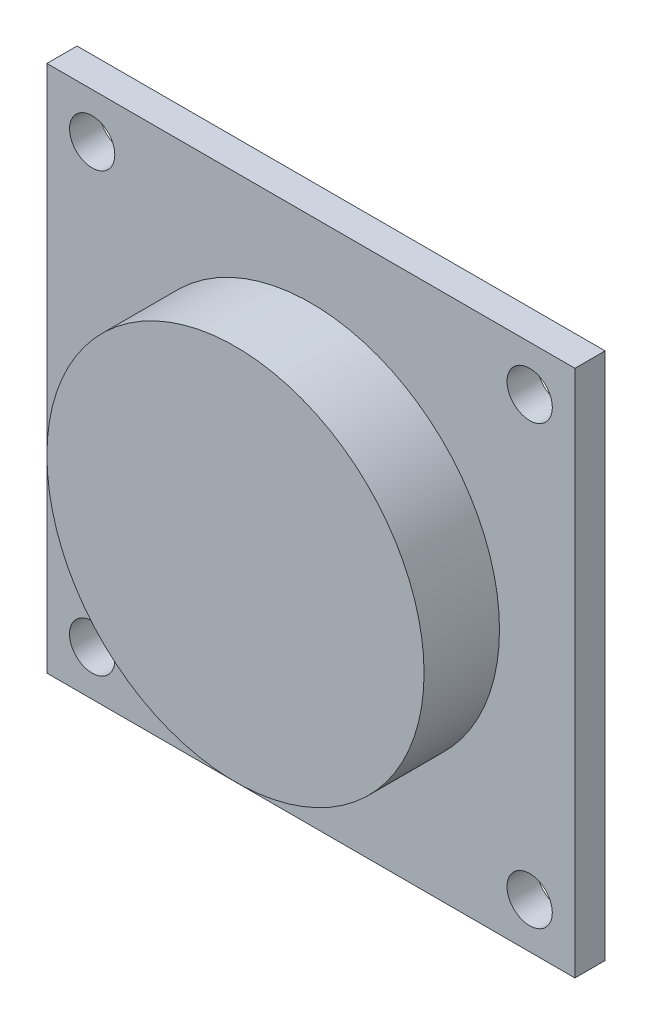
ISO-10303-21;
HEADER;
FILE_DESCRIPTION(('STEP AP214'),'2;1');
FILE_NAME('part.step','',(''),(''),'','','');
FILE_SCHEMA(('AUTOMOTIVE_DESIGN { 1 0 10303 214 1 1 1 1 }'));
ENDSEC;
DATA;
#1=APPLICATION_CONTEXT('core data for automotive mechanical design processes');
#2=APPLICATION_PROTOCOL_DEFINITION('international standard','automotive_design',2000,#1);
#3=PRODUCT_CONTEXT('',#1,'mechanical');
#4=PRODUCT('Part','Part','',(#3));
#5=PRODUCT_RELATED_PRODUCT_CATEGORY('part','',(#4));
#6=PRODUCT_DEFINITION_FORMATION('','',#4);
#7=PRODUCT_DEFINITION_CONTEXT('part definition',#1,'design');
#8=PRODUCT_DEFINITION('design','',#6,#7);
#9=PRODUCT_DEFINITION_SHAPE('','',#8);
#10=(LENGTH_UNIT() NAMED_UNIT(*) SI_UNIT(.MILLI.,.METRE.));
#11=(NAMED_UNIT(*) PLANE_ANGLE_UNIT() SI_UNIT($,.RADIAN.));
#12=(NAMED_UNIT(*) SI_UNIT($,.STERADIAN.) SOLID_ANGLE_UNIT());
#13=UNCERTAINTY_MEASURE_WITH_UNIT(LENGTH_MEASURE(1.E-05),#10,'distance_accuracy_value','');
#14=(GEOMETRIC_REPRESENTATION_CONTEXT(3) GLOBAL_UNCERTAINTY_ASSIGNED_CONTEXT((#13)) GLOBAL_UNIT_ASSIGNED_CONTEXT((#10,
#11,#12)) REPRESENTATION_CONTEXT('',''));
#15=CARTESIAN_POINT('',(0.,0.,0.));
#16=DIRECTION('',(0.,0.,1.));
#17=DIRECTION('',(1.,0.,0.));
#18=AXIS2_PLACEMENT_3D('',#15,#16,#17);
#19=CARTESIAN_POINT('',(-35.,35.,4.));
#20=DIRECTION('',(1.,0.,0.));
#21=DIRECTION('',(0.,1.,0.));
#22=AXIS2_PLACEMENT_3D('',#19,#20,#21);
#23=PLANE('',#22);
#24=DIRECTION('',(0.,-1.,0.));
#25=VECTOR('',#24,1.);
#26=CARTESIAN_POINT('',(-35.,35.,0.));
#27=LINE('',#26,#25);
#28=CARTESIAN_POINT('',(-35.,35.,0.));
#29=VERTEX_POINT('',#28);
#30=CARTESIAN_POINT('',(-35.,-35.,0.));
#31=VERTEX_POINT('',#30);
#32=EDGE_CURVE('E110',#29,#31,#27,.T.);
#33=ORIENTED_EDGE('',*,*,#32,.T.);
#34=DIRECTION('',(0.,0.,-1.));
#35=VECTOR('',#34,1.);
#36=CARTESIAN_POINT('',(-35.,-35.,4.));
#37=LINE('',#36,#35);
#38=CARTESIAN_POINT('',(-35.,-35.,4.));
#39=VERTEX_POINT('',#38);
#40=EDGE_CURVE('E97',#39,#31,#37,.T.);
#41=ORIENTED_EDGE('',*,*,#40,.F.);
#42=DIRECTION('',(0.,-1.,0.));
#43=VECTOR('',#42,1.);
#44=CARTESIAN_POINT('',(-35.,35.,4.));
#45=LINE('',#44,#43);
#46=CARTESIAN_POINT('',(-35.,35.,4.));
#47=VERTEX_POINT('',#46);
#48=EDGE_CURVE('E116',#47,#39,#45,.T.);
#49=ORIENTED_EDGE('',*,*,#48,.F.);
#50=DIRECTION('',(0.,0.,-1.));
#51=VECTOR('',#50,1.);
#52=CARTESIAN_POINT('',(-35.,35.,4.));
#53=LINE('',#52,#51);
#54=EDGE_CURVE('E99',#47,#29,#53,.T.);
#55=ORIENTED_EDGE('',*,*,#54,.T.);
#56=EDGE_LOOP('',(#33,#41,#49,#55));
#57=FACE_BOUND('',#56,.T.);
#58=ADVANCED_FACE('F43',(#57),#23,.F.);
#59=CARTESIAN_POINT('',(35.,-35.,4.));
#60=DIRECTION('',(0.,1.,0.));
#61=DIRECTION('',(-1.,0.,0.));
#62=AXIS2_PLACEMENT_3D('',#59,#60,#61);
#63=PLANE('',#62);
#64=DIRECTION('',(1.,0.,0.));
#65=VECTOR('',#64,1.);
#66=CARTESIAN_POINT('',(35.,-35.,0.));
#67=LINE('',#66,#65);
#68=CARTESIAN_POINT('',(35.,-35.,0.));
#69=VERTEX_POINT('',#68);
#70=EDGE_CURVE('E60',#31,#69,#67,.T.);
#71=ORIENTED_EDGE('',*,*,#70,.T.);
#72=DIRECTION('',(0.,0.,-1.));
#73=VECTOR('',#72,1.);
#74=CARTESIAN_POINT('',(35.,-35.,4.));
#75=LINE('',#74,#73);
#76=CARTESIAN_POINT('',(35.,-35.,4.));
#77=VERTEX_POINT('',#76);
#78=EDGE_CURVE('E94',#77,#69,#75,.T.);
#79=ORIENTED_EDGE('',*,*,#78,.F.);
#80=DIRECTION('',(1.,0.,0.));
#81=VECTOR('',#80,1.);
#82=CARTESIAN_POINT('',(35.,-35.,4.));
#83=LINE('',#82,#81);
#84=EDGE_CURVE('E76',#39,#77,#83,.T.);
#85=ORIENTED_EDGE('',*,*,#84,.F.);
#86=ORIENTED_EDGE('',*,*,#40,.T.);
#87=EDGE_LOOP('',(#71,#79,#85,#86));
#88=FACE_BOUND('',#87,.T.);
#89=ADVANCED_FACE('F93',(#88),#63,.F.);
#90=CARTESIAN_POINT('',(35.,35.,4.));
#91=DIRECTION('',(-1.,0.,0.));
#92=DIRECTION('',(0.,0.,1.));
#93=AXIS2_PLACEMENT_3D('',#90,#91,#92);
#94=PLANE('',#93);
#95=DIRECTION('',(0.,1.,0.));
#96=VECTOR('',#95,1.);
#97=CARTESIAN_POINT('',(35.,35.,0.));
#98=LINE('',#97,#96);
#99=CARTESIAN_POINT('',(35.,35.,0.));
#100=VERTEX_POINT('',#99);
#101=EDGE_CURVE('E91',#69,#100,#98,.T.);
#102=ORIENTED_EDGE('',*,*,#101,.T.);
#103=DIRECTION('',(0.,0.,-1.));
#104=VECTOR('',#103,1.);
#105=CARTESIAN_POINT('',(35.,35.,4.));
#106=LINE('',#105,#104);
#107=CARTESIAN_POINT('',(35.,35.,4.));
#108=VERTEX_POINT('',#107);
#109=EDGE_CURVE('E119',#108,#100,#106,.T.);
#110=ORIENTED_EDGE('',*,*,#109,.F.);
#111=DIRECTION('',(0.,1.,0.));
#112=VECTOR('',#111,1.);
#113=CARTESIAN_POINT('',(35.,35.,4.));
#114=LINE('',#113,#112);
#115=EDGE_CURVE('E102',#77,#108,#114,.T.);
#116=ORIENTED_EDGE('',*,*,#115,.F.);
#117=ORIENTED_EDGE('',*,*,#78,.T.);
#118=EDGE_LOOP('',(#102,#110,#116,#117));
#119=FACE_BOUND('',#118,.T.);
#120=ADVANCED_FACE('F101',(#119),#94,.F.);
#121=CARTESIAN_POINT('',(35.,35.,4.));
#122=DIRECTION('',(0.,-1.,0.));
#123=DIRECTION('',(1.,0.,0.));
#124=AXIS2_PLACEMENT_3D('',#121,#122,#123);
#125=PLANE('',#124);
#126=DIRECTION('',(-1.,0.,0.));
#127=VECTOR('',#126,1.);
#128=CARTESIAN_POINT('',(35.,35.,0.));
#129=LINE('',#128,#127);
#130=EDGE_CURVE('E85',#100,#29,#129,.T.);
#131=ORIENTED_EDGE('',*,*,#130,.T.);
#132=ORIENTED_EDGE('',*,*,#54,.F.);
#133=DIRECTION('',(-1.,0.,0.));
#134=VECTOR('',#133,1.);
#135=CARTESIAN_POINT('',(35.,35.,4.));
#136=LINE('',#135,#134);
#137=EDGE_CURVE('E52',#108,#47,#136,.T.);
#138=ORIENTED_EDGE('',*,*,#137,.F.);
#139=ORIENTED_EDGE('',*,*,#109,.T.);
#140=EDGE_LOOP('',(#131,#132,#138,#139));
#141=FACE_BOUND('',#140,.T.);
#142=ADVANCED_FACE('F126',(#141),#125,.F.);
#143=CARTESIAN_POINT('',(0.,0.,4.));
#144=DIRECTION('',(0.,0.,-1.));
#145=DIRECTION('',(-1.,0.,0.));
#146=AXIS2_PLACEMENT_3D('',#143,#144,#145);
#147=PLANE('',#146);
#148=CARTESIAN_POINT('',(29.,29.,4.));
#149=DIRECTION('',(0.,0.,1.));
#150=DIRECTION('',(-1.,0.,0.));
#151=AXIS2_PLACEMENT_3D('',#148,#149,#150);
#152=CIRCLE('',#151,3.00031163254123);
#153=CARTESIAN_POINT('',(25.9996883674588,29.,4.));
#154=VERTEX_POINT('',#153);
#155=EDGE_CURVE('E254',#154,#154,#152,.T.);
#156=ORIENTED_EDGE('',*,*,#155,.F.);
#157=EDGE_LOOP('',(#156));
#158=FACE_BOUND('',#157,.T.);
#159=CARTESIAN_POINT('',(-29.,-29.,4.));
#160=DIRECTION('',(0.,0.,1.));
#161=DIRECTION('',(-1.,0.,0.));
#162=AXIS2_PLACEMENT_3D('',#159,#160,#161);
#163=CIRCLE('',#162,3.00031163254123);
#164=CARTESIAN_POINT('',(-32.0003116325412,-29.,4.));
#165=VERTEX_POINT('',#164);
#166=EDGE_CURVE('E259',#165,#165,#163,.T.);
#167=ORIENTED_EDGE('',*,*,#166,.F.);
#168=EDGE_LOOP('',(#167));
#169=FACE_BOUND('',#168,.T.);
#170=CARTESIAN_POINT('',(29.,-29.,4.));
#171=DIRECTION('',(0.,0.,1.));
#172=DIRECTION('',(1.,0.,0.));
#173=AXIS2_PLACEMENT_3D('',#170,#171,#172);
#174=CIRCLE('',#173,3.00031163254123);
#175=CARTESIAN_POINT('',(32.0003116325412,-29.,4.));
#176=VERTEX_POINT('',#175);
#177=EDGE_CURVE('E267',#176,#176,#174,.T.);
#178=ORIENTED_EDGE('',*,*,#177,.F.);
#179=EDGE_LOOP('',(#178));
#180=FACE_BOUND('',#179,.T.);
#181=CARTESIAN_POINT('',(-29.,29.,4.));
#182=DIRECTION('',(0.,0.,1.));
#183=DIRECTION('',(1.,0.,0.));
#184=AXIS2_PLACEMENT_3D('',#181,#182,#183);
#185=CIRCLE('',#184,3.00031163254123);
#186=CARTESIAN_POINT('',(-25.9996883674588,29.,4.));
#187=VERTEX_POINT('',#186);
#188=EDGE_CURVE('E112',#187,#187,#185,.T.);
#189=ORIENTED_EDGE('',*,*,#188,.F.);
#190=EDGE_LOOP('',(#189));
#191=FACE_BOUND('',#190,.T.);
#192=CARTESIAN_POINT('',(0.,0.,4.));
#193=DIRECTION('',(0.,0.,-1.));
#194=DIRECTION('',(-1.,0.,0.));
#195=AXIS2_PLACEMENT_3D('',#192,#193,#194);
#196=CIRCLE('',#195,25.);
#197=CARTESIAN_POINT('',(-25.,0.,4.));
#198=VERTEX_POINT('',#197);
#199=EDGE_CURVE('E117',#198,#198,#196,.T.);
#200=ORIENTED_EDGE('',*,*,#199,.T.);
#201=EDGE_LOOP('',(#200));
#202=FACE_BOUND('',#201,.T.);
#203=ORIENTED_EDGE('',*,*,#48,.T.);
#204=ORIENTED_EDGE('',*,*,#84,.T.);
#205=ORIENTED_EDGE('',*,*,#115,.T.);
#206=ORIENTED_EDGE('',*,*,#137,.T.);
#207=EDGE_LOOP('',(#203,#204,#205,#206));
#208=FACE_BOUND('',#207,.T.);
#209=ADVANCED_FACE('F127',(#158,#169,#180,#191,#202,#208),#147,.F.);
#210=CARTESIAN_POINT('',(0.,0.,0.));
#211=DIRECTION('',(0.,0.,-1.));
#212=DIRECTION('',(-1.,0.,0.));
#213=AXIS2_PLACEMENT_3D('',#210,#211,#212);
#214=PLANE('',#213);
#215=CARTESIAN_POINT('',(29.,29.,0.));
#216=DIRECTION('',(0.,0.,-1.));
#217=DIRECTION('',(-1.,0.,0.));
#218=AXIS2_PLACEMENT_3D('',#215,#216,#217);
#219=CIRCLE('',#218,3.00031163254123);
#220=CARTESIAN_POINT('',(25.9996883674588,29.,0.));
#221=VERTEX_POINT('',#220);
#222=EDGE_CURVE('E252',#221,#221,#219,.F.);
#223=ORIENTED_EDGE('',*,*,#222,.T.);
#224=EDGE_LOOP('',(#223));
#225=FACE_BOUND('',#224,.T.);
#226=CARTESIAN_POINT('',(-29.,-29.,0.));
#227=DIRECTION('',(0.,0.,-1.));
#228=DIRECTION('',(-1.,0.,0.));
#229=AXIS2_PLACEMENT_3D('',#226,#227,#228);
#230=CIRCLE('',#229,3.00031163254123);
#231=CARTESIAN_POINT('',(-32.0003116325412,-29.,0.));
#232=VERTEX_POINT('',#231);
#233=EDGE_CURVE('E264',#232,#232,#230,.F.);
#234=ORIENTED_EDGE('',*,*,#233,.T.);
#235=EDGE_LOOP('',(#234));
#236=FACE_BOUND('',#235,.T.);
#237=CARTESIAN_POINT('',(29.,-29.,0.));
#238=DIRECTION('',(0.,0.,-1.));
#239=DIRECTION('',(-1.,0.,0.));
#240=AXIS2_PLACEMENT_3D('',#237,#238,#239);
#241=CIRCLE('',#240,3.00031163254123);
#242=CARTESIAN_POINT('',(25.9996883674588,-29.,0.));
#243=VERTEX_POINT('',#242);
#244=EDGE_CURVE('E270',#243,#243,#241,.F.);
#245=ORIENTED_EDGE('',*,*,#244,.T.);
#246=EDGE_LOOP('',(#245));
#247=FACE_BOUND('',#246,.T.);
#248=CARTESIAN_POINT('',(-29.,29.,0.));
#249=DIRECTION('',(0.,0.,-1.));
#250=DIRECTION('',(-1.,0.,0.));
#251=AXIS2_PLACEMENT_3D('',#248,#249,#250);
#252=CIRCLE('',#251,3.00031163254123);
#253=CARTESIAN_POINT('',(-32.0003116325412,29.,0.));
#254=VERTEX_POINT('',#253);
#255=EDGE_CURVE('E255',#254,#254,#252,.F.);
#256=ORIENTED_EDGE('',*,*,#255,.T.);
#257=EDGE_LOOP('',(#256));
#258=FACE_BOUND('',#257,.T.);
#259=CARTESIAN_POINT('',(0.,0.,0.));
#260=DIRECTION('',(0.,0.,-1.));
#261=DIRECTION('',(-1.,0.,0.));
#262=AXIS2_PLACEMENT_3D('',#259,#260,#261);
#263=CIRCLE('',#262,29.);
#264=CARTESIAN_POINT('',(-29.,0.,0.));
#265=VERTEX_POINT('',#264);
#266=EDGE_CURVE('E12',#265,#265,#263,.F.);
#267=ORIENTED_EDGE('',*,*,#266,.T.);
#268=EDGE_LOOP('',(#267));
#269=FACE_BOUND('',#268,.T.);
#270=ORIENTED_EDGE('',*,*,#32,.F.);
#271=ORIENTED_EDGE('',*,*,#130,.F.);
#272=ORIENTED_EDGE('',*,*,#101,.F.);
#273=ORIENTED_EDGE('',*,*,#70,.F.);
#274=EDGE_LOOP('',(#270,#271,#272,#273));
#275=FACE_BOUND('',#274,.T.);
#276=ADVANCED_FACE('F104',(#225,#236,#247,#258,#269,#275),#214,.T.);
#277=CARTESIAN_POINT('',(0.,0.,4.));
#278=DIRECTION('',(0.,0.,-1.));
#279=DIRECTION('',(-1.,0.,0.));
#280=AXIS2_PLACEMENT_3D('',#277,#278,#279);
#281=TOROIDAL_SURFACE('',#280,29.,4.);
#282=ORIENTED_EDGE('',*,*,#266,.F.);
#283=EDGE_LOOP('',(#282));
#284=FACE_BOUND('',#283,.T.);
#285=ORIENTED_EDGE('',*,*,#199,.F.);
#286=EDGE_LOOP('',(#285));
#287=FACE_BOUND('',#286,.T.);
#288=ADVANCED_FACE('F45',(#284,#287),#281,.T.);
#289=CARTESIAN_POINT('',(-29.,29.,-0.00100000000000013));
#290=DIRECTION('',(0.,0.,1.));
#291=DIRECTION('',(1.,0.,0.));
#292=AXIS2_PLACEMENT_3D('',#289,#290,#291);
#293=CYLINDRICAL_SURFACE('',#292,3.00031163254123);
#294=ORIENTED_EDGE('',*,*,#255,.F.);
#295=EDGE_LOOP('',(#294));
#296=FACE_BOUND('',#295,.T.);
#297=ORIENTED_EDGE('',*,*,#188,.T.);
#298=EDGE_LOOP('',(#297));
#299=FACE_BOUND('',#298,.T.);
#300=ADVANCED_FACE('F146',(#296,#299),#293,.F.);
#301=CARTESIAN_POINT('',(29.,-29.,-0.00100000000000013));
#302=DIRECTION('',(0.,0.,1.));
#303=DIRECTION('',(1.,0.,0.));
#304=AXIS2_PLACEMENT_3D('',#301,#302,#303);
#305=CYLINDRICAL_SURFACE('',#304,3.00031163254123);
#306=ORIENTED_EDGE('',*,*,#244,.F.);
#307=EDGE_LOOP('',(#306));
#308=FACE_BOUND('',#307,.T.);
#309=ORIENTED_EDGE('',*,*,#177,.T.);
#310=EDGE_LOOP('',(#309));
#311=FACE_BOUND('',#310,.T.);
#312=ADVANCED_FACE('F190',(#308,#311),#305,.F.);
#313=CARTESIAN_POINT('',(-29.,-29.,-0.00100000000000013));
#314=DIRECTION('',(0.,0.,1.));
#315=DIRECTION('',(1.,0.,0.));
#316=AXIS2_PLACEMENT_3D('',#313,#314,#315);
#317=CYLINDRICAL_SURFACE('',#316,3.00031163254123);
#318=ORIENTED_EDGE('',*,*,#233,.F.);
#319=EDGE_LOOP('',(#318));
#320=FACE_BOUND('',#319,.T.);
#321=ORIENTED_EDGE('',*,*,#166,.T.);
#322=EDGE_LOOP('',(#321));
#323=FACE_BOUND('',#322,.T.);
#324=ADVANCED_FACE('F197',(#320,#323),#317,.F.);
#325=CARTESIAN_POINT('',(29.,29.,-0.00100000000000013));
#326=DIRECTION('',(0.,0.,1.));
#327=DIRECTION('',(1.,0.,0.));
#328=AXIS2_PLACEMENT_3D('',#325,#326,#327);
#329=CYLINDRICAL_SURFACE('',#328,3.00031163254123);
#330=ORIENTED_EDGE('',*,*,#222,.F.);
#331=EDGE_LOOP('',(#330));
#332=FACE_BOUND('',#331,.T.);
#333=ORIENTED_EDGE('',*,*,#155,.T.);
#334=EDGE_LOOP('',(#333));
#335=FACE_BOUND('',#334,.T.);
#336=ADVANCED_FACE('F203',(#332,#335),#329,.F.);
#337=CLOSED_SHELL('',(#58,#89,#120,#142,#209,#276,#288,#300,#312,#324,#336));
#338=MANIFOLD_SOLID_BREP('B2',#337);
#339=CARTESIAN_POINT('',(0.,0.,14.));
#340=DIRECTION('',(0.,0.,1.));
#341=DIRECTION('',(1.,0.,0.));
#342=AXIS2_PLACEMENT_3D('',#339,#340,#341);
#343=PLANE('',#342);
#344=CARTESIAN_POINT('',(0.,0.,14.));
#345=DIRECTION('',(0.,0.,1.));
#346=DIRECTION('',(1.,0.,0.));
#347=AXIS2_PLACEMENT_3D('',#344,#345,#346);
#348=CIRCLE('',#347,25.);
#349=CARTESIAN_POINT('',(25.,0.,14.));
#350=VERTEX_POINT('',#349);
#351=EDGE_CURVE('E42',#350,#350,#348,.T.);
#352=ORIENTED_EDGE('',*,*,#351,.T.);
#353=EDGE_LOOP('',(#352));
#354=FACE_BOUND('',#353,.T.);
#355=ADVANCED_FACE('F294',(#354),#343,.T.);
#356=CARTESIAN_POINT('',(0.,0.,14.));
#357=DIRECTION('',(0.,0.,-1.));
#358=DIRECTION('',(-1.,0.,0.));
#359=AXIS2_PLACEMENT_3D('',#356,#357,#358);
#360=CYLINDRICAL_SURFACE('',#359,25.);
#361=ORIENTED_EDGE('',*,*,#351,.F.);
#362=EDGE_LOOP('',(#361));
#363=FACE_BOUND('',#362,.T.);
#364=CARTESIAN_POINT('',(0.,0.,4.));
#365=DIRECTION('',(0.,0.,-1.));
#366=DIRECTION('',(-1.,0.,0.));
#367=AXIS2_PLACEMENT_3D('',#364,#365,#366);
#368=CIRCLE('',#367,25.);
#369=CARTESIAN_POINT('',(-25.,0.,4.));
#370=VERTEX_POINT('',#369);
#371=EDGE_CURVE('E301',#370,#370,#368,.T.);
#372=ORIENTED_EDGE('',*,*,#371,.F.);
#373=EDGE_LOOP('',(#372));
#374=FACE_BOUND('',#373,.T.);
#375=ADVANCED_FACE('F296',(#363,#374),#360,.T.);
#376=CARTESIAN_POINT('',(0.,0.,4.));
#377=DIRECTION('',(0.,0.,-1.));
#378=DIRECTION('',(-1.,0.,0.));
#379=AXIS2_PLACEMENT_3D('',#376,#377,#378);
#380=PLANE('',#379);
#381=ORIENTED_EDGE('',*,*,#371,.T.);
#382=EDGE_LOOP('',(#381));
#383=FACE_BOUND('',#382,.T.);
#384=ADVANCED_FACE('F307',(#383),#380,.T.);
#385=CLOSED_SHELL('',(#355,#375,#384));
#386=MANIFOLD_SOLID_BREP('B6',#385);
#387=ADVANCED_BREP_SHAPE_REPRESENTATION('',(#18,#338,#386),#14);
#388=SHAPE_DEFINITION_REPRESENTATION(#9,#387);
ENDSEC;
END-ISO-10303-21;
